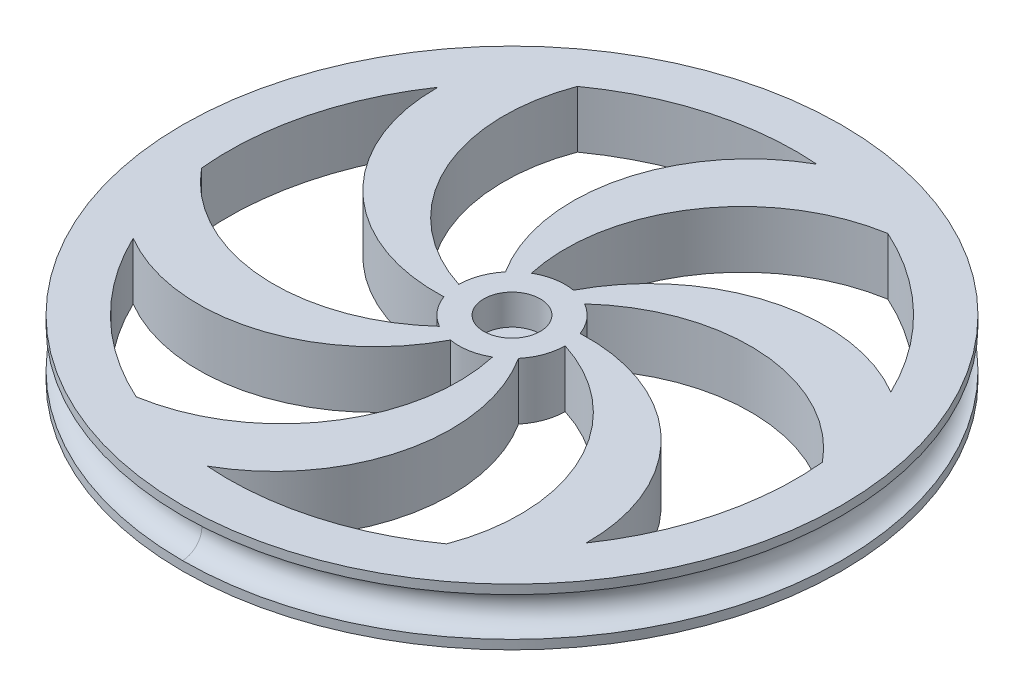
ISO-10303-21;
HEADER;
FILE_DESCRIPTION(('STEP AP214'),'2;1');
FILE_NAME('part.step','',(''),(''),'','','');
FILE_SCHEMA(('AUTOMOTIVE_DESIGN { 1 0 10303 214 1 1 1 1 }'));
ENDSEC;
DATA;
#1=APPLICATION_CONTEXT('core data for automotive mechanical design processes');
#2=APPLICATION_PROTOCOL_DEFINITION('international standard','automotive_design',2000,#1);
#3=PRODUCT_CONTEXT('',#1,'mechanical');
#4=PRODUCT('Part','Part','',(#3));
#5=PRODUCT_RELATED_PRODUCT_CATEGORY('part','',(#4));
#6=PRODUCT_DEFINITION_FORMATION('','',#4);
#7=PRODUCT_DEFINITION_CONTEXT('part definition',#1,'design');
#8=PRODUCT_DEFINITION('design','',#6,#7);
#9=PRODUCT_DEFINITION_SHAPE('','',#8);
#10=(LENGTH_UNIT() NAMED_UNIT(*) SI_UNIT(.MILLI.,.METRE.));
#11=(NAMED_UNIT(*) PLANE_ANGLE_UNIT() SI_UNIT($,.RADIAN.));
#12=(NAMED_UNIT(*) SI_UNIT($,.STERADIAN.) SOLID_ANGLE_UNIT());
#13=UNCERTAINTY_MEASURE_WITH_UNIT(LENGTH_MEASURE(1.E-05),#10,'distance_accuracy_value','');
#14=(GEOMETRIC_REPRESENTATION_CONTEXT(3) GLOBAL_UNCERTAINTY_ASSIGNED_CONTEXT((#13)) GLOBAL_UNIT_ASSIGNED_CONTEXT((#10,
#11,#12)) REPRESENTATION_CONTEXT('',''));
#15=CARTESIAN_POINT('',(0.,0.,0.));
#16=DIRECTION('',(0.,0.,1.));
#17=DIRECTION('',(1.,0.,0.));
#18=AXIS2_PLACEMENT_3D('',#15,#16,#17);
#19=CARTESIAN_POINT('',(0.,0.,0.));
#20=DIRECTION('',(0.,-1.,0.));
#21=DIRECTION('',(0.,0.,-1.));
#22=AXIS2_PLACEMENT_3D('',#19,#20,#21);
#23=CYLINDRICAL_SURFACE('',#22,1.2446);
#24=CARTESIAN_POINT('',(0.,0.,0.));
#25=DIRECTION('',(0.,-1.,0.));
#26=DIRECTION('',(0.,0.,-1.));
#27=AXIS2_PLACEMENT_3D('',#24,#25,#26);
#28=CIRCLE('',#27,1.2446);
#29=CARTESIAN_POINT('',(0.,0.,-1.2446));
#30=VERTEX_POINT('',#29);
#31=EDGE_CURVE('E675',#30,#30,#28,.T.);
#32=ORIENTED_EDGE('',*,*,#31,.T.);
#33=EDGE_LOOP('',(#32));
#34=FACE_BOUND('',#33,.T.);
#35=CARTESIAN_POINT('',(0.,2.2225,0.));
#36=DIRECTION('',(0.,1.,0.));
#37=DIRECTION('',(0.,0.,1.));
#38=AXIS2_PLACEMENT_3D('',#35,#36,#37);
#39=CIRCLE('',#38,1.2446);
#40=CARTESIAN_POINT('',(0.,2.2225,1.2446));
#41=VERTEX_POINT('',#40);
#42=EDGE_CURVE('E238',#41,#41,#39,.F.);
#43=ORIENTED_EDGE('',*,*,#42,.F.);
#44=EDGE_LOOP('',(#43));
#45=FACE_BOUND('',#44,.T.);
#46=ADVANCED_FACE('F234',(#34,#45),#23,.F.);
#47=CARTESIAN_POINT('',(0.,4.7625,0.));
#48=DIRECTION('',(0.,-1.,0.));
#49=DIRECTION('',(0.,0.,-1.));
#50=AXIS2_PLACEMENT_3D('',#47,#48,#49);
#51=CYLINDRICAL_SURFACE('',#50,27.559);
#52=CARTESIAN_POINT('',(0.,0.,0.));
#53=DIRECTION('',(0.,1.,0.));
#54=DIRECTION('',(0.,0.,1.));
#55=AXIS2_PLACEMENT_3D('',#52,#53,#54);
#56=CIRCLE('',#55,27.559);
#57=CARTESIAN_POINT('',(0.,0.,27.559));
#58=VERTEX_POINT('',#57);
#59=EDGE_CURVE('E695',#58,#58,#56,.T.);
#60=ORIENTED_EDGE('',*,*,#59,.T.);
#61=EDGE_LOOP('',(#60));
#62=FACE_BOUND('',#61,.T.);
#63=CARTESIAN_POINT('',(0.,0.762000000000004,0.));
#64=DIRECTION('',(0.,1.,0.));
#65=DIRECTION('',(0.,0.,1.));
#66=AXIS2_PLACEMENT_3D('',#63,#64,#65);
#67=CIRCLE('',#66,27.559);
#68=CARTESIAN_POINT('',(0.,0.762000000000004,27.559));
#69=VERTEX_POINT('',#68);
#70=CARTESIAN_POINT('',(-27.559,0.762000000000004,0.));
#71=VERTEX_POINT('',#70);
#72=EDGE_CURVE('E12',#69,#71,#67,.T.);
#73=ORIENTED_EDGE('',*,*,#72,.F.);
#74=CARTESIAN_POINT('',(0.,0.762000000000004,0.));
#75=DIRECTION('',(0.,1.,0.));
#76=DIRECTION('',(0.,0.,1.));
#77=AXIS2_PLACEMENT_3D('',#74,#75,#76);
#78=CIRCLE('',#77,27.559);
#79=EDGE_CURVE('E244',#71,#69,#78,.T.);
#80=ORIENTED_EDGE('',*,*,#79,.F.);
#81=EDGE_LOOP('',(#73,#80));
#82=FACE_BOUND('',#81,.T.);
#83=ADVANCED_FACE('F236',(#62,#82),#51,.T.);
#84=CARTESIAN_POINT('',(0.,0.,0.));
#85=DIRECTION('',(0.,1.,0.));
#86=DIRECTION('',(0.,0.,1.));
#87=AXIS2_PLACEMENT_3D('',#84,#85,#86);
#88=PLANE('',#87);
#89=CARTESIAN_POINT('',(0.,0.,0.));
#90=DIRECTION('',(0.,1.,0.));
#91=DIRECTION('',(0.,0.,1.));
#92=AXIS2_PLACEMENT_3D('',#89,#90,#91);
#93=CIRCLE('',#92,4.445);
#94=CARTESIAN_POINT('',(-0.771866149729499,0.,4.37747046213927));
#95=VERTEX_POINT('',#94);
#96=CARTESIAN_POINT('',(2.2225,0.,3.84948291982183));
#97=VERTEX_POINT('',#96);
#98=EDGE_CURVE('E512',#95,#97,#93,.T.);
#99=ORIENTED_EDGE('',*,*,#98,.F.);
#100=CARTESIAN_POINT('',(-13.8828348942131,0.,-2.44791836057071));
#101=DIRECTION('',(0.,1.,0.));
#102=DIRECTION('',(0.,0.,1.));
#103=AXIS2_PLACEMENT_3D('',#100,#101,#102);
#104=CIRCLE('',#103,14.7811851351642);
#105=CARTESIAN_POINT('',(-21.4129214501009,0.,10.2714067182547));
#106=VERTEX_POINT('',#105);
#107=EDGE_CURVE('E515',#95,#106,#104,.F.);
#108=ORIENTED_EDGE('',*,*,#107,.T.);
#109=CARTESIAN_POINT('',(0.,0.,0.));
#110=DIRECTION('',(0.,1.,0.));
#111=DIRECTION('',(0.,0.,1.));
#112=AXIS2_PLACEMENT_3D('',#109,#110,#111);
#113=CIRCLE('',#112,23.749);
#114=CARTESIAN_POINT('',(-9.80091651524777,0.,21.63231463485));
#115=VERTEX_POINT('',#114);
#116=EDGE_CURVE('E251',#106,#115,#113,.T.);
#117=ORIENTED_EDGE('',*,*,#116,.T.);
#118=CARTESIAN_POINT('',(-12.2083601171492,0.,7.0485));
#119=DIRECTION('',(0.,1.,0.));
#120=DIRECTION('',(0.,0.,1.));
#121=AXIS2_PLACEMENT_3D('',#118,#119,#120);
#122=CIRCLE('',#121,14.7811851351642);
#123=EDGE_CURVE('E522',#97,#115,#122,.F.);
#124=ORIENTED_EDGE('',*,*,#123,.F.);
#125=EDGE_LOOP('',(#99,#108,#117,#124));
#126=FACE_BOUND('',#125,.T.);
#127=CARTESIAN_POINT('',(0.,0.,0.));
#128=DIRECTION('',(0.,1.,0.));
#129=DIRECTION('',(0.,0.,1.));
#130=AXIS2_PLACEMENT_3D('',#127,#128,#129);
#131=CIRCLE('',#130,4.445);
#132=CARTESIAN_POINT('',(-4.17693369939336,0.,1.5202795370826));
#133=VERTEX_POINT('',#132);
#134=CARTESIAN_POINT('',(-2.2225,0.,3.84948291982183));
#135=VERTEX_POINT('',#134);
#136=EDGE_CURVE('E470',#133,#135,#131,.T.);
#137=ORIENTED_EDGE('',*,*,#136,.F.);
#138=CARTESIAN_POINT('',(-4.82145796046196,0.,-13.2468468752189));
#139=DIRECTION('',(0.,1.,0.));
#140=DIRECTION('',(0.,0.,1.));
#141=AXIS2_PLACEMENT_3D('',#138,#139,#140);
#142=CIRCLE('',#141,14.7811851351642);
#143=CARTESIAN_POINT('',(-19.6017598756612,0.,-13.4084305859008));
#144=VERTEX_POINT('',#143);
#145=EDGE_CURVE('E473',#133,#144,#142,.F.);
#146=ORIENTED_EDGE('',*,*,#145,.T.);
#147=CARTESIAN_POINT('',(0.,0.,0.));
#148=DIRECTION('',(0.,1.,0.));
#149=DIRECTION('',(0.,0.,1.));
#150=AXIS2_PLACEMENT_3D('',#147,#148,#149);
#151=CIRCLE('',#150,23.749);
#152=CARTESIAN_POINT('',(-23.6345922740618,0.,2.32831463484995));
#153=VERTEX_POINT('',#152);
#154=EDGE_CURVE('E259',#144,#153,#151,.T.);
#155=ORIENTED_EDGE('',*,*,#154,.T.);
#156=CARTESIAN_POINT('',(-12.2083601171492,0.,-7.0485));
#157=DIRECTION('',(0.,1.,0.));
#158=DIRECTION('',(0.,0.,1.));
#159=AXIS2_PLACEMENT_3D('',#156,#157,#158);
#160=CIRCLE('',#159,14.7811851351642);
#161=EDGE_CURVE('E480',#135,#153,#160,.F.);
#162=ORIENTED_EDGE('',*,*,#161,.F.);
#163=EDGE_LOOP('',(#137,#146,#155,#162));
#164=FACE_BOUND('',#163,.T.);
#165=CARTESIAN_POINT('',(12.2083601171492,0.,7.04849999999999));
#166=DIRECTION('',(0.,1.,0.));
#167=DIRECTION('',(0.,0.,1.));
#168=AXIS2_PLACEMENT_3D('',#165,#166,#167);
#169=CIRCLE('',#168,14.7811851351642);
#170=CARTESIAN_POINT('',(2.2225,0.,-3.84948291982183));
#171=VERTEX_POINT('',#170);
#172=CARTESIAN_POINT('',(23.6345922740618,0.,-2.32831463484997));
#173=VERTEX_POINT('',#172);
#174=EDGE_CURVE('E598',#171,#173,#169,.F.);
#175=ORIENTED_EDGE('',*,*,#174,.F.);
#176=CARTESIAN_POINT('',(0.,0.,0.));
#177=DIRECTION('',(0.,1.,0.));
#178=DIRECTION('',(0.,0.,1.));
#179=AXIS2_PLACEMENT_3D('',#176,#177,#178);
#180=CIRCLE('',#179,4.445);
#181=CARTESIAN_POINT('',(4.17693369939336,0.,-1.5202795370826));
#182=VERTEX_POINT('',#181);
#183=EDGE_CURVE('E601',#182,#171,#180,.T.);
#184=ORIENTED_EDGE('',*,*,#183,.F.);
#185=CARTESIAN_POINT('',(4.82145796046196,0.,13.2468468752189));
#186=DIRECTION('',(0.,1.,0.));
#187=DIRECTION('',(0.,0.,1.));
#188=AXIS2_PLACEMENT_3D('',#185,#186,#187);
#189=CIRCLE('',#188,14.7811851351642);
#190=CARTESIAN_POINT('',(19.6017598756612,0.,13.4084305859008));
#191=VERTEX_POINT('',#190);
#192=EDGE_CURVE('E605',#182,#191,#189,.F.);
#193=ORIENTED_EDGE('',*,*,#192,.T.);
#194=CARTESIAN_POINT('',(0.,0.,0.));
#195=DIRECTION('',(0.,1.,0.));
#196=DIRECTION('',(0.,0.,1.));
#197=AXIS2_PLACEMENT_3D('',#194,#195,#196);
#198=CIRCLE('',#197,23.749);
#199=EDGE_CURVE('E609',#191,#173,#198,.T.);
#200=ORIENTED_EDGE('',*,*,#199,.T.);
#201=EDGE_LOOP('',(#175,#184,#193,#200));
#202=FACE_BOUND('',#201,.T.);
#203=CARTESIAN_POINT('',(0.,0.,0.));
#204=DIRECTION('',(0.,1.,0.));
#205=DIRECTION('',(0.,0.,1.));
#206=AXIS2_PLACEMENT_3D('',#203,#204,#205);
#207=CIRCLE('',#206,4.445);
#208=CARTESIAN_POINT('',(3.40506754966386,0.,2.85719092505666));
#209=VERTEX_POINT('',#208);
#210=CARTESIAN_POINT('',(4.445,0.,0.));
#211=VERTEX_POINT('',#210);
#212=EDGE_CURVE('E554',#209,#211,#207,.T.);
#213=ORIENTED_EDGE('',*,*,#212,.F.);
#214=CARTESIAN_POINT('',(-9.06137693375113,0.,10.7989285146482));
#215=DIRECTION('',(0.,1.,0.));
#216=DIRECTION('',(0.,0.,1.));
#217=AXIS2_PLACEMENT_3D('',#214,#215,#216);
#218=CIRCLE('',#217,14.7811851351642);
#219=CARTESIAN_POINT('',(-1.8111615744397,0.,23.6798373041555));
#220=VERTEX_POINT('',#219);
#221=EDGE_CURVE('E557',#209,#220,#218,.F.);
#222=ORIENTED_EDGE('',*,*,#221,.T.);
#223=CARTESIAN_POINT('',(0.,0.,0.));
#224=DIRECTION('',(0.,1.,0.));
#225=DIRECTION('',(0.,0.,1.));
#226=AXIS2_PLACEMENT_3D('',#223,#224,#225);
#227=CIRCLE('',#226,23.749);
#228=CARTESIAN_POINT('',(13.8336757588141,0.,19.304));
#229=VERTEX_POINT('',#228);
#230=EDGE_CURVE('E562',#220,#229,#227,.T.);
#231=ORIENTED_EDGE('',*,*,#230,.T.);
#232=CARTESIAN_POINT('',(0.,0.,14.097));
#233=DIRECTION('',(0.,1.,0.));
#234=DIRECTION('',(0.,0.,1.));
#235=AXIS2_PLACEMENT_3D('',#232,#233,#234);
#236=CIRCLE('',#235,14.7811851351642);
#237=EDGE_CURVE('E566',#211,#229,#236,.F.);
#238=ORIENTED_EDGE('',*,*,#237,.F.);
#239=EDGE_LOOP('',(#213,#222,#231,#238));
#240=FACE_BOUND('',#239,.T.);
#241=CARTESIAN_POINT('',(0.,0.,0.));
#242=DIRECTION('',(0.,1.,0.));
#243=DIRECTION('',(0.,0.,1.));
#244=AXIS2_PLACEMENT_3D('',#241,#242,#243);
#245=CIRCLE('',#244,4.445);
#246=CARTESIAN_POINT('',(-3.40506754966386,0.,-2.85719092505667));
#247=VERTEX_POINT('',#246);
#248=CARTESIAN_POINT('',(-4.445,0.,0.));
#249=VERTEX_POINT('',#248);
#250=EDGE_CURVE('E415',#247,#249,#245,.T.);
#251=ORIENTED_EDGE('',*,*,#250,.F.);
#252=CARTESIAN_POINT('',(9.06137693375113,0.,-10.7989285146482));
#253=DIRECTION('',(0.,1.,0.));
#254=DIRECTION('',(0.,0.,1.));
#255=AXIS2_PLACEMENT_3D('',#252,#253,#254);
#256=CIRCLE('',#255,14.7811851351642);
#257=CARTESIAN_POINT('',(1.81116157443972,0.,-23.6798373041555));
#258=VERTEX_POINT('',#257);
#259=EDGE_CURVE('E428',#247,#258,#256,.F.);
#260=ORIENTED_EDGE('',*,*,#259,.T.);
#261=CARTESIAN_POINT('',(0.,0.,0.));
#262=DIRECTION('',(0.,1.,0.));
#263=DIRECTION('',(0.,0.,1.));
#264=AXIS2_PLACEMENT_3D('',#261,#262,#263);
#265=CIRCLE('',#264,23.749);
#266=CARTESIAN_POINT('',(-13.8336757588141,0.,-19.304));
#267=VERTEX_POINT('',#266);
#268=EDGE_CURVE('E433',#258,#267,#265,.T.);
#269=ORIENTED_EDGE('',*,*,#268,.T.);
#270=CARTESIAN_POINT('',(0.,0.,-14.097));
#271=DIRECTION('',(0.,1.,0.));
#272=DIRECTION('',(0.,0.,1.));
#273=AXIS2_PLACEMENT_3D('',#270,#271,#272);
#274=CIRCLE('',#273,14.7811851351642);
#275=EDGE_CURVE('E424',#249,#267,#274,.F.);
#276=ORIENTED_EDGE('',*,*,#275,.F.);
#277=EDGE_LOOP('',(#251,#260,#269,#276));
#278=FACE_BOUND('',#277,.T.);
#279=CARTESIAN_POINT('',(0.,0.,0.));
#280=DIRECTION('',(0.,1.,0.));
#281=DIRECTION('',(0.,0.,1.));
#282=AXIS2_PLACEMENT_3D('',#279,#280,#281);
#283=CIRCLE('',#282,4.445);
#284=CARTESIAN_POINT('',(0.771866149729505,0.,-4.37747046213926));
#285=VERTEX_POINT('',#284);
#286=CARTESIAN_POINT('',(-2.2225,0.,-3.84948291982183));
#287=VERTEX_POINT('',#286);
#288=EDGE_CURVE('E641',#285,#287,#283,.T.);
#289=ORIENTED_EDGE('',*,*,#288,.F.);
#290=CARTESIAN_POINT('',(13.8828348942131,0.,2.44791836057069));
#291=DIRECTION('',(0.,1.,0.));
#292=DIRECTION('',(0.,0.,1.));
#293=AXIS2_PLACEMENT_3D('',#290,#291,#292);
#294=CIRCLE('',#293,14.7811851351642);
#295=CARTESIAN_POINT('',(21.4129214501009,0.,-10.2714067182547));
#296=VERTEX_POINT('',#295);
#297=EDGE_CURVE('E644',#285,#296,#294,.F.);
#298=ORIENTED_EDGE('',*,*,#297,.T.);
#299=CARTESIAN_POINT('',(0.,0.,0.));
#300=DIRECTION('',(0.,1.,0.));
#301=DIRECTION('',(0.,0.,1.));
#302=AXIS2_PLACEMENT_3D('',#299,#300,#301);
#303=CIRCLE('',#302,23.749);
#304=CARTESIAN_POINT('',(9.80091651524776,0.,-21.63231463485));
#305=VERTEX_POINT('',#304);
#306=EDGE_CURVE('E649',#296,#305,#303,.T.);
#307=ORIENTED_EDGE('',*,*,#306,.T.);
#308=CARTESIAN_POINT('',(12.2083601171492,0.,-7.0485));
#309=DIRECTION('',(0.,1.,0.));
#310=DIRECTION('',(0.,0.,1.));
#311=AXIS2_PLACEMENT_3D('',#308,#309,#310);
#312=CIRCLE('',#311,14.7811851351642);
#313=EDGE_CURVE('E653',#287,#305,#312,.F.);
#314=ORIENTED_EDGE('',*,*,#313,.F.);
#315=EDGE_LOOP('',(#289,#298,#307,#314));
#316=FACE_BOUND('',#315,.T.);
#317=ORIENTED_EDGE('',*,*,#31,.F.);
#318=EDGE_LOOP('',(#317));
#319=FACE_BOUND('',#318,.T.);
#320=ORIENTED_EDGE('',*,*,#59,.F.);
#321=EDGE_LOOP('',(#320));
#322=FACE_BOUND('',#321,.T.);
#323=ADVANCED_FACE('F436',(#126,#164,#202,#240,#278,#316,#319,#322),#88,.F.);
#324=CARTESIAN_POINT('',(0.,2.38125,0.));
#325=DIRECTION('',(0.,-1.,0.));
#326=DIRECTION('',(0.,0.,-1.));
#327=AXIS2_PLACEMENT_3D('',#324,#325,#326);
#328=TOROIDAL_SURFACE('',#327,27.559,1.61925);
#329=ORIENTED_EDGE('',*,*,#72,.T.);
#330=CARTESIAN_POINT('',(-27.559,2.38125,0.));
#331=DIRECTION('',(0.,0.,1.));
#332=DIRECTION('',(1.,0.,0.));
#333=AXIS2_PLACEMENT_3D('',#330,#331,#332);
#334=CIRCLE('',#333,1.61925);
#335=CARTESIAN_POINT('',(-27.559,4.0005,0.));
#336=VERTEX_POINT('',#335);
#337=EDGE_CURVE('E688',#71,#336,#334,.T.);
#338=ORIENTED_EDGE('',*,*,#337,.T.);
#339=CARTESIAN_POINT('',(0.,4.0005,0.));
#340=DIRECTION('',(0.,-1.,0.));
#341=DIRECTION('',(0.,0.,-1.));
#342=AXIS2_PLACEMENT_3D('',#339,#340,#341);
#343=CIRCLE('',#342,27.559);
#344=CARTESIAN_POINT('',(0.,4.0005,27.559));
#345=VERTEX_POINT('',#344);
#346=EDGE_CURVE('E706',#336,#345,#343,.T.);
#347=ORIENTED_EDGE('',*,*,#346,.T.);
#348=CARTESIAN_POINT('',(0.,2.38125,27.559));
#349=DIRECTION('',(1.,0.,0.));
#350=DIRECTION('',(0.,0.,-1.));
#351=AXIS2_PLACEMENT_3D('',#348,#349,#350);
#352=CIRCLE('',#351,1.61925);
#353=EDGE_CURVE('E692',#69,#345,#352,.T.);
#354=ORIENTED_EDGE('',*,*,#353,.F.);
#355=EDGE_LOOP('',(#329,#338,#347,#354));
#356=FACE_BOUND('',#355,.T.);
#357=ADVANCED_FACE('F718',(#356),#328,.F.);
#358=CARTESIAN_POINT('',(0.,2.38125,0.));
#359=DIRECTION('',(0.,-1.,0.));
#360=DIRECTION('',(0.,0.,-1.));
#361=AXIS2_PLACEMENT_3D('',#358,#359,#360);
#362=TOROIDAL_SURFACE('',#361,27.559,1.61925);
#363=ORIENTED_EDGE('',*,*,#79,.T.);
#364=ORIENTED_EDGE('',*,*,#353,.T.);
#365=CARTESIAN_POINT('',(0.,4.0005,0.));
#366=DIRECTION('',(0.,-1.,0.));
#367=DIRECTION('',(0.,0.,-1.));
#368=AXIS2_PLACEMENT_3D('',#365,#366,#367);
#369=CIRCLE('',#368,27.559);
#370=EDGE_CURVE('E700',#345,#336,#369,.T.);
#371=ORIENTED_EDGE('',*,*,#370,.T.);
#372=ORIENTED_EDGE('',*,*,#337,.F.);
#373=EDGE_LOOP('',(#363,#364,#371,#372));
#374=FACE_BOUND('',#373,.T.);
#375=ADVANCED_FACE('F714',(#374),#362,.F.);
#376=CARTESIAN_POINT('',(0.,4.7625,0.));
#377=DIRECTION('',(0.,1.,0.));
#378=DIRECTION('',(0.,0.,1.));
#379=AXIS2_PLACEMENT_3D('',#376,#377,#378);
#380=PLANE('',#379);
#381=CARTESIAN_POINT('',(0.,4.7625,0.));
#382=DIRECTION('',(0.,1.,0.));
#383=DIRECTION('',(0.,0.,1.));
#384=AXIS2_PLACEMENT_3D('',#381,#382,#383);
#385=CIRCLE('',#384,2.3622);
#386=CARTESIAN_POINT('',(0.,4.7625,2.3622));
#387=VERTEX_POINT('',#386);
#388=EDGE_CURVE('E446',#387,#387,#385,.T.);
#389=ORIENTED_EDGE('',*,*,#388,.F.);
#390=EDGE_LOOP('',(#389));
#391=FACE_BOUND('',#390,.T.);
#392=CARTESIAN_POINT('',(-13.8828348942131,4.7625,-2.44791836057071));
#393=DIRECTION('',(0.,1.,0.));
#394=DIRECTION('',(0.,0.,1.));
#395=AXIS2_PLACEMENT_3D('',#392,#393,#394);
#396=CIRCLE('',#395,14.7811851351642);
#397=CARTESIAN_POINT('',(-0.771866149729499,4.7625,4.37747046213926));
#398=VERTEX_POINT('',#397);
#399=CARTESIAN_POINT('',(-21.4129214501009,4.7625,10.2714067182547));
#400=VERTEX_POINT('',#399);
#401=EDGE_CURVE('E529',#398,#400,#396,.F.);
#402=ORIENTED_EDGE('',*,*,#401,.F.);
#403=CARTESIAN_POINT('',(0.,4.7625,0.));
#404=DIRECTION('',(0.,1.,0.));
#405=DIRECTION('',(0.,0.,1.));
#406=AXIS2_PLACEMENT_3D('',#403,#404,#405);
#407=CIRCLE('',#406,4.445);
#408=CARTESIAN_POINT('',(2.2225,4.7625,3.84948291982183));
#409=VERTEX_POINT('',#408);
#410=EDGE_CURVE('E502',#398,#409,#407,.T.);
#411=ORIENTED_EDGE('',*,*,#410,.T.);
#412=CARTESIAN_POINT('',(-12.2083601171492,4.7625,7.0485));
#413=DIRECTION('',(0.,1.,0.));
#414=DIRECTION('',(0.,0.,1.));
#415=AXIS2_PLACEMENT_3D('',#412,#413,#414);
#416=CIRCLE('',#415,14.7811851351642);
#417=CARTESIAN_POINT('',(-9.80091651524777,4.7625,21.63231463485));
#418=VERTEX_POINT('',#417);
#419=EDGE_CURVE('E516',#409,#418,#416,.F.);
#420=ORIENTED_EDGE('',*,*,#419,.T.);
#421=CARTESIAN_POINT('',(0.,4.7625,0.));
#422=DIRECTION('',(0.,1.,0.));
#423=DIRECTION('',(0.,0.,1.));
#424=AXIS2_PLACEMENT_3D('',#421,#422,#423);
#425=CIRCLE('',#424,23.749);
#426=EDGE_CURVE('E533',#400,#418,#425,.T.);
#427=ORIENTED_EDGE('',*,*,#426,.F.);
#428=EDGE_LOOP('',(#402,#411,#420,#427));
#429=FACE_BOUND('',#428,.T.);
#430=CARTESIAN_POINT('',(-4.82145796046196,4.7625,-13.2468468752189));
#431=DIRECTION('',(0.,1.,0.));
#432=DIRECTION('',(0.,0.,1.));
#433=AXIS2_PLACEMENT_3D('',#430,#431,#432);
#434=CIRCLE('',#433,14.7811851351642);
#435=CARTESIAN_POINT('',(-4.17693369939336,4.7625,1.5202795370826));
#436=VERTEX_POINT('',#435);
#437=CARTESIAN_POINT('',(-19.6017598756612,4.7625,-13.4084305859008));
#438=VERTEX_POINT('',#437);
#439=EDGE_CURVE('E487',#436,#438,#434,.F.);
#440=ORIENTED_EDGE('',*,*,#439,.F.);
#441=CARTESIAN_POINT('',(0.,4.7625,0.));
#442=DIRECTION('',(0.,1.,0.));
#443=DIRECTION('',(0.,0.,1.));
#444=AXIS2_PLACEMENT_3D('',#441,#442,#443);
#445=CIRCLE('',#444,4.445);
#446=CARTESIAN_POINT('',(-2.2225,4.7625,3.84948291982183));
#447=VERTEX_POINT('',#446);
#448=EDGE_CURVE('E464',#436,#447,#445,.T.);
#449=ORIENTED_EDGE('',*,*,#448,.T.);
#450=CARTESIAN_POINT('',(-12.2083601171492,4.7625,-7.0485));
#451=DIRECTION('',(0.,1.,0.));
#452=DIRECTION('',(0.,0.,1.));
#453=AXIS2_PLACEMENT_3D('',#450,#451,#452);
#454=CIRCLE('',#453,14.7811851351642);
#455=CARTESIAN_POINT('',(-23.6345922740618,4.7625,2.32831463484995));
#456=VERTEX_POINT('',#455);
#457=EDGE_CURVE('E474',#447,#456,#454,.F.);
#458=ORIENTED_EDGE('',*,*,#457,.T.);
#459=CARTESIAN_POINT('',(0.,4.7625,0.));
#460=DIRECTION('',(0.,1.,0.));
#461=DIRECTION('',(0.,0.,1.));
#462=AXIS2_PLACEMENT_3D('',#459,#460,#461);
#463=CIRCLE('',#462,23.749);
#464=EDGE_CURVE('E491',#438,#456,#463,.T.);
#465=ORIENTED_EDGE('',*,*,#464,.F.);
#466=EDGE_LOOP('',(#440,#449,#458,#465));
#467=FACE_BOUND('',#466,.T.);
#468=CARTESIAN_POINT('',(0.,4.7625,0.));
#469=DIRECTION('',(0.,1.,0.));
#470=DIRECTION('',(0.,0.,1.));
#471=AXIS2_PLACEMENT_3D('',#468,#469,#470);
#472=CIRCLE('',#471,4.445);
#473=CARTESIAN_POINT('',(4.17693369939336,4.7625,-1.5202795370826));
#474=VERTEX_POINT('',#473);
#475=CARTESIAN_POINT('',(2.2225,4.7625,-3.84948291982183));
#476=VERTEX_POINT('',#475);
#477=EDGE_CURVE('E617',#474,#476,#472,.T.);
#478=ORIENTED_EDGE('',*,*,#477,.T.);
#479=CARTESIAN_POINT('',(12.2083601171492,4.7625,7.04849999999999));
#480=DIRECTION('',(0.,1.,0.));
#481=DIRECTION('',(0.,0.,1.));
#482=AXIS2_PLACEMENT_3D('',#479,#480,#481);
#483=CIRCLE('',#482,14.7811851351642);
#484=CARTESIAN_POINT('',(23.6345922740618,4.7625,-2.32831463484997));
#485=VERTEX_POINT('',#484);
#486=EDGE_CURVE('E588',#476,#485,#483,.F.);
#487=ORIENTED_EDGE('',*,*,#486,.T.);
#488=CARTESIAN_POINT('',(0.,4.7625,0.));
#489=DIRECTION('',(0.,1.,0.));
#490=DIRECTION('',(0.,0.,1.));
#491=AXIS2_PLACEMENT_3D('',#488,#489,#490);
#492=CIRCLE('',#491,23.749);
#493=CARTESIAN_POINT('',(19.6017598756612,4.7625,13.4084305859008));
#494=VERTEX_POINT('',#493);
#495=EDGE_CURVE('E602',#494,#485,#492,.T.);
#496=ORIENTED_EDGE('',*,*,#495,.F.);
#497=CARTESIAN_POINT('',(4.82145796046196,4.7625,13.2468468752189));
#498=DIRECTION('',(0.,1.,0.));
#499=DIRECTION('',(0.,0.,1.));
#500=AXIS2_PLACEMENT_3D('',#497,#498,#499);
#501=CIRCLE('',#500,14.7811851351642);
#502=EDGE_CURVE('E621',#474,#494,#501,.F.);
#503=ORIENTED_EDGE('',*,*,#502,.F.);
#504=EDGE_LOOP('',(#478,#487,#496,#503));
#505=FACE_BOUND('',#504,.T.);
#506=CARTESIAN_POINT('',(-9.06137693375113,4.7625,10.7989285146482));
#507=DIRECTION('',(0.,1.,0.));
#508=DIRECTION('',(0.,0.,1.));
#509=AXIS2_PLACEMENT_3D('',#506,#507,#508);
#510=CIRCLE('',#509,14.7811851351642);
#511=CARTESIAN_POINT('',(3.40506754966386,4.7625,2.85719092505666));
#512=VERTEX_POINT('',#511);
#513=CARTESIAN_POINT('',(-1.8111615744397,4.7625,23.6798373041555));
#514=VERTEX_POINT('',#513);
#515=EDGE_CURVE('E573',#512,#514,#510,.F.);
#516=ORIENTED_EDGE('',*,*,#515,.F.);
#517=CARTESIAN_POINT('',(0.,4.7625,0.));
#518=DIRECTION('',(0.,1.,0.));
#519=DIRECTION('',(0.,0.,1.));
#520=AXIS2_PLACEMENT_3D('',#517,#518,#519);
#521=CIRCLE('',#520,4.445);
#522=CARTESIAN_POINT('',(4.445,4.7625,0.));
#523=VERTEX_POINT('',#522);
#524=EDGE_CURVE('E544',#512,#523,#521,.T.);
#525=ORIENTED_EDGE('',*,*,#524,.T.);
#526=CARTESIAN_POINT('',(0.,4.7625,14.097));
#527=DIRECTION('',(0.,1.,0.));
#528=DIRECTION('',(0.,0.,1.));
#529=AXIS2_PLACEMENT_3D('',#526,#527,#528);
#530=CIRCLE('',#529,14.7811851351642);
#531=CARTESIAN_POINT('',(13.8336757588141,4.7625,19.304));
#532=VERTEX_POINT('',#531);
#533=EDGE_CURVE('E558',#523,#532,#530,.F.);
#534=ORIENTED_EDGE('',*,*,#533,.T.);
#535=CARTESIAN_POINT('',(0.,4.7625,0.));
#536=DIRECTION('',(0.,1.,0.));
#537=DIRECTION('',(0.,0.,1.));
#538=AXIS2_PLACEMENT_3D('',#535,#536,#537);
#539=CIRCLE('',#538,23.749);
#540=EDGE_CURVE('E577',#514,#532,#539,.T.);
#541=ORIENTED_EDGE('',*,*,#540,.F.);
#542=EDGE_LOOP('',(#516,#525,#534,#541));
#543=FACE_BOUND('',#542,.T.);
#544=CARTESIAN_POINT('',(9.06137693375113,4.7625,-10.7989285146482));
#545=DIRECTION('',(0.,1.,0.));
#546=DIRECTION('',(0.,0.,1.));
#547=AXIS2_PLACEMENT_3D('',#544,#545,#546);
#548=CIRCLE('',#547,14.7811851351642);
#549=CARTESIAN_POINT('',(-3.40506754966386,4.7625,-2.85719092505667));
#550=VERTEX_POINT('',#549);
#551=CARTESIAN_POINT('',(1.81116157443972,4.7625,-23.6798373041555));
#552=VERTEX_POINT('',#551);
#553=EDGE_CURVE('E455',#550,#552,#548,.F.);
#554=ORIENTED_EDGE('',*,*,#553,.F.);
#555=CARTESIAN_POINT('',(0.,4.7625,0.));
#556=DIRECTION('',(0.,1.,0.));
#557=DIRECTION('',(0.,0.,1.));
#558=AXIS2_PLACEMENT_3D('',#555,#556,#557);
#559=CIRCLE('',#558,4.445);
#560=CARTESIAN_POINT('',(-4.445,4.7625,0.));
#561=VERTEX_POINT('',#560);
#562=EDGE_CURVE('E418',#550,#561,#559,.T.);
#563=ORIENTED_EDGE('',*,*,#562,.T.);
#564=CARTESIAN_POINT('',(0.,4.7625,-14.097));
#565=DIRECTION('',(0.,1.,0.));
#566=DIRECTION('',(0.,0.,1.));
#567=AXIS2_PLACEMENT_3D('',#564,#565,#566);
#568=CIRCLE('',#567,14.7811851351642);
#569=CARTESIAN_POINT('',(-13.8336757588141,4.7625,-19.304));
#570=VERTEX_POINT('',#569);
#571=EDGE_CURVE('E439',#561,#570,#568,.F.);
#572=ORIENTED_EDGE('',*,*,#571,.T.);
#573=CARTESIAN_POINT('',(0.,4.7625,0.));
#574=DIRECTION('',(0.,1.,0.));
#575=DIRECTION('',(0.,0.,1.));
#576=AXIS2_PLACEMENT_3D('',#573,#574,#575);
#577=CIRCLE('',#576,23.749);
#578=EDGE_CURVE('E443',#552,#570,#577,.T.);
#579=ORIENTED_EDGE('',*,*,#578,.F.);
#580=EDGE_LOOP('',(#554,#563,#572,#579));
#581=FACE_BOUND('',#580,.T.);
#582=CARTESIAN_POINT('',(13.8828348942131,4.7625,2.44791836057069));
#583=DIRECTION('',(0.,1.,0.));
#584=DIRECTION('',(0.,0.,1.));
#585=AXIS2_PLACEMENT_3D('',#582,#583,#584);
#586=CIRCLE('',#585,14.7811851351642);
#587=CARTESIAN_POINT('',(0.771866149729504,4.7625,-4.37747046213926));
#588=VERTEX_POINT('',#587);
#589=CARTESIAN_POINT('',(21.4129214501009,4.7625,-10.2714067182547));
#590=VERTEX_POINT('',#589);
#591=EDGE_CURVE('E660',#588,#590,#586,.F.);
#592=ORIENTED_EDGE('',*,*,#591,.F.);
#593=CARTESIAN_POINT('',(0.,4.7625,0.));
#594=DIRECTION('',(0.,1.,0.));
#595=DIRECTION('',(0.,0.,1.));
#596=AXIS2_PLACEMENT_3D('',#593,#594,#595);
#597=CIRCLE('',#596,4.445);
#598=CARTESIAN_POINT('',(-2.2225,4.7625,-3.84948291982183));
#599=VERTEX_POINT('',#598);
#600=EDGE_CURVE('E631',#588,#599,#597,.T.);
#601=ORIENTED_EDGE('',*,*,#600,.T.);
#602=CARTESIAN_POINT('',(12.2083601171492,4.7625,-7.0485));
#603=DIRECTION('',(0.,1.,0.));
#604=DIRECTION('',(0.,0.,1.));
#605=AXIS2_PLACEMENT_3D('',#602,#603,#604);
#606=CIRCLE('',#605,14.7811851351642);
#607=CARTESIAN_POINT('',(9.80091651524776,4.7625,-21.63231463485));
#608=VERTEX_POINT('',#607);
#609=EDGE_CURVE('E645',#599,#608,#606,.F.);
#610=ORIENTED_EDGE('',*,*,#609,.T.);
#611=CARTESIAN_POINT('',(0.,4.7625,0.));
#612=DIRECTION('',(0.,1.,0.));
#613=DIRECTION('',(0.,0.,1.));
#614=AXIS2_PLACEMENT_3D('',#611,#612,#613);
#615=CIRCLE('',#614,23.749);
#616=EDGE_CURVE('E664',#590,#608,#615,.T.);
#617=ORIENTED_EDGE('',*,*,#616,.F.);
#618=EDGE_LOOP('',(#592,#601,#610,#617));
#619=FACE_BOUND('',#618,.T.);
#620=CARTESIAN_POINT('',(0.,4.7625,0.));
#621=DIRECTION('',(0.,1.,0.));
#622=DIRECTION('',(0.,0.,1.));
#623=AXIS2_PLACEMENT_3D('',#620,#621,#622);
#624=CIRCLE('',#623,27.559);
#625=CARTESIAN_POINT('',(0.,4.7625,27.559));
#626=VERTEX_POINT('',#625);
#627=EDGE_CURVE('E696',#626,#626,#624,.T.);
#628=ORIENTED_EDGE('',*,*,#627,.T.);
#629=EDGE_LOOP('',(#628));
#630=FACE_BOUND('',#629,.T.);
#631=ADVANCED_FACE('F733',(#391,#429,#467,#505,#543,#581,#619,#630),#380,.T.);
#632=ORIENTED_EDGE('',*,*,#627,.F.);
#633=EDGE_LOOP('',(#632));
#634=FACE_BOUND('',#633,.T.);
#635=ORIENTED_EDGE('',*,*,#346,.F.);
#636=ORIENTED_EDGE('',*,*,#370,.F.);
#637=EDGE_LOOP('',(#635,#636));
#638=FACE_BOUND('',#637,.T.);
#639=ADVANCED_FACE('F723',(#634,#638),#51,.T.);
#640=CARTESIAN_POINT('',(0.,0.,0.));
#641=DIRECTION('',(0.,1.,0.));
#642=DIRECTION('',(0.,0.,1.));
#643=AXIS2_PLACEMENT_3D('',#640,#641,#642);
#644=CYLINDRICAL_SURFACE('',#643,4.445);
#645=ORIENTED_EDGE('',*,*,#600,.F.);
#646=DIRECTION('',(0.,1.,0.));
#647=VECTOR('',#646,1.);
#648=CARTESIAN_POINT('',(0.771866149729505,0.,-4.37747046213926));
#649=LINE('',#648,#647);
#650=EDGE_CURVE('E656',#285,#588,#649,.T.);
#651=ORIENTED_EDGE('',*,*,#650,.F.);
#652=ORIENTED_EDGE('',*,*,#288,.T.);
#653=DIRECTION('',(0.,1.,0.));
#654=VECTOR('',#653,1.);
#655=CARTESIAN_POINT('',(-2.2225,0.,-3.84948291982183));
#656=LINE('',#655,#654);
#657=EDGE_CURVE('E671',#287,#599,#656,.T.);
#658=ORIENTED_EDGE('',*,*,#657,.T.);
#659=EDGE_LOOP('',(#645,#651,#652,#658));
#660=FACE_BOUND('',#659,.T.);
#661=ADVANCED_FACE('F732',(#660),#644,.T.);
#662=CARTESIAN_POINT('',(12.2083601171492,0.,-7.0485));
#663=DIRECTION('',(0.,1.,0.));
#664=DIRECTION('',(0.,0.,1.));
#665=AXIS2_PLACEMENT_3D('',#662,#663,#664);
#666=CYLINDRICAL_SURFACE('',#665,14.7811851351642);
#667=ORIENTED_EDGE('',*,*,#609,.F.);
#668=ORIENTED_EDGE('',*,*,#657,.F.);
#669=ORIENTED_EDGE('',*,*,#313,.T.);
#670=DIRECTION('',(0.,1.,0.));
#671=VECTOR('',#670,1.);
#672=CARTESIAN_POINT('',(9.80091651524776,0.,-21.63231463485));
#673=LINE('',#672,#671);
#674=EDGE_CURVE('E676',#305,#608,#673,.T.);
#675=ORIENTED_EDGE('',*,*,#674,.T.);
#676=EDGE_LOOP('',(#667,#668,#669,#675));
#677=FACE_BOUND('',#676,.T.);
#678=ADVANCED_FACE('F739',(#677),#666,.F.);
#679=CARTESIAN_POINT('',(0.,0.,0.));
#680=DIRECTION('',(0.,1.,0.));
#681=DIRECTION('',(0.,0.,1.));
#682=AXIS2_PLACEMENT_3D('',#679,#680,#681);
#683=CYLINDRICAL_SURFACE('',#682,23.749);
#684=ORIENTED_EDGE('',*,*,#616,.T.);
#685=ORIENTED_EDGE('',*,*,#674,.F.);
#686=ORIENTED_EDGE('',*,*,#306,.F.);
#687=DIRECTION('',(0.,1.,0.));
#688=VECTOR('',#687,1.);
#689=CARTESIAN_POINT('',(21.4129214501009,0.,-10.2714067182547));
#690=LINE('',#689,#688);
#691=EDGE_CURVE('E679',#296,#590,#690,.T.);
#692=ORIENTED_EDGE('',*,*,#691,.T.);
#693=EDGE_LOOP('',(#684,#685,#686,#692));
#694=FACE_BOUND('',#693,.T.);
#695=ADVANCED_FACE('F759',(#694),#683,.F.);
#696=CARTESIAN_POINT('',(13.8828348942131,0.,2.44791836057069));
#697=DIRECTION('',(0.,1.,0.));
#698=DIRECTION('',(0.,0.,1.));
#699=AXIS2_PLACEMENT_3D('',#696,#697,#698);
#700=CYLINDRICAL_SURFACE('',#699,14.7811851351642);
#701=ORIENTED_EDGE('',*,*,#591,.T.);
#702=ORIENTED_EDGE('',*,*,#691,.F.);
#703=ORIENTED_EDGE('',*,*,#297,.F.);
#704=ORIENTED_EDGE('',*,*,#650,.T.);
#705=EDGE_LOOP('',(#701,#702,#703,#704));
#706=FACE_BOUND('',#705,.T.);
#707=ADVANCED_FACE('F756',(#706),#700,.T.);
#708=CARTESIAN_POINT('',(0.,0.,0.));
#709=DIRECTION('',(0.,1.,0.));
#710=DIRECTION('',(0.,0.,1.));
#711=AXIS2_PLACEMENT_3D('',#708,#709,#710);
#712=CYLINDRICAL_SURFACE('',#711,4.445);
#713=ORIENTED_EDGE('',*,*,#562,.F.);
#714=DIRECTION('',(0.,1.,0.));
#715=VECTOR('',#714,1.);
#716=CARTESIAN_POINT('',(-3.40506754966386,0.,-2.85719092505667));
#717=LINE('',#716,#715);
#718=EDGE_CURVE('E410',#247,#550,#717,.T.);
#719=ORIENTED_EDGE('',*,*,#718,.F.);
#720=ORIENTED_EDGE('',*,*,#250,.T.);
#721=DIRECTION('',(0.,1.,0.));
#722=VECTOR('',#721,1.);
#723=CARTESIAN_POINT('',(-4.445,0.,0.));
#724=LINE('',#723,#722);
#725=EDGE_CURVE('E461',#249,#561,#724,.T.);
#726=ORIENTED_EDGE('',*,*,#725,.T.);
#727=EDGE_LOOP('',(#713,#719,#720,#726));
#728=FACE_BOUND('',#727,.T.);
#729=ADVANCED_FACE('F412',(#728),#712,.T.);
#730=CARTESIAN_POINT('',(0.,0.,-14.097));
#731=DIRECTION('',(0.,1.,0.));
#732=DIRECTION('',(0.,0.,1.));
#733=AXIS2_PLACEMENT_3D('',#730,#731,#732);
#734=CYLINDRICAL_SURFACE('',#733,14.7811851351642);
#735=ORIENTED_EDGE('',*,*,#571,.F.);
#736=ORIENTED_EDGE('',*,*,#725,.F.);
#737=ORIENTED_EDGE('',*,*,#275,.T.);
#738=DIRECTION('',(0.,1.,0.));
#739=VECTOR('',#738,1.);
#740=CARTESIAN_POINT('',(-13.8336757588141,0.,-19.304));
#741=LINE('',#740,#739);
#742=EDGE_CURVE('E465',#267,#570,#741,.T.);
#743=ORIENTED_EDGE('',*,*,#742,.T.);
#744=EDGE_LOOP('',(#735,#736,#737,#743));
#745=FACE_BOUND('',#744,.T.);
#746=ADVANCED_FACE('F832',(#745),#734,.F.);
#747=CARTESIAN_POINT('',(0.,0.,0.));
#748=DIRECTION('',(0.,1.,0.));
#749=DIRECTION('',(0.,0.,1.));
#750=AXIS2_PLACEMENT_3D('',#747,#748,#749);
#751=CYLINDRICAL_SURFACE('',#750,23.749);
#752=ORIENTED_EDGE('',*,*,#578,.T.);
#753=ORIENTED_EDGE('',*,*,#742,.F.);
#754=ORIENTED_EDGE('',*,*,#268,.F.);
#755=DIRECTION('',(0.,1.,0.));
#756=VECTOR('',#755,1.);
#757=CARTESIAN_POINT('',(1.81116157443972,0.,-23.6798373041555));
#758=LINE('',#757,#756);
#759=EDGE_CURVE('E423',#258,#552,#758,.T.);
#760=ORIENTED_EDGE('',*,*,#759,.T.);
#761=EDGE_LOOP('',(#752,#753,#754,#760));
#762=FACE_BOUND('',#761,.T.);
#763=ADVANCED_FACE('F835',(#762),#751,.F.);
#764=CARTESIAN_POINT('',(9.06137693375113,0.,-10.7989285146482));
#765=DIRECTION('',(0.,1.,0.));
#766=DIRECTION('',(0.,0.,1.));
#767=AXIS2_PLACEMENT_3D('',#764,#765,#766);
#768=CYLINDRICAL_SURFACE('',#767,14.7811851351642);
#769=ORIENTED_EDGE('',*,*,#553,.T.);
#770=ORIENTED_EDGE('',*,*,#759,.F.);
#771=ORIENTED_EDGE('',*,*,#259,.F.);
#772=ORIENTED_EDGE('',*,*,#718,.T.);
#773=EDGE_LOOP('',(#769,#770,#771,#772));
#774=FACE_BOUND('',#773,.T.);
#775=ADVANCED_FACE('F429',(#774),#768,.T.);
#776=CARTESIAN_POINT('',(0.,0.,0.));
#777=DIRECTION('',(0.,1.,0.));
#778=DIRECTION('',(0.,0.,1.));
#779=AXIS2_PLACEMENT_3D('',#776,#777,#778);
#780=CYLINDRICAL_SURFACE('',#779,4.445);
#781=ORIENTED_EDGE('',*,*,#524,.F.);
#782=DIRECTION('',(0.,1.,0.));
#783=VECTOR('',#782,1.);
#784=CARTESIAN_POINT('',(3.40506754966386,0.,2.85719092505666));
#785=LINE('',#784,#783);
#786=EDGE_CURVE('E569',#209,#512,#785,.T.);
#787=ORIENTED_EDGE('',*,*,#786,.F.);
#788=ORIENTED_EDGE('',*,*,#212,.T.);
#789=DIRECTION('',(0.,1.,0.));
#790=VECTOR('',#789,1.);
#791=CARTESIAN_POINT('',(4.445,0.,0.));
#792=LINE('',#791,#790);
#793=EDGE_CURVE('E584',#211,#523,#792,.T.);
#794=ORIENTED_EDGE('',*,*,#793,.T.);
#795=EDGE_LOOP('',(#781,#787,#788,#794));
#796=FACE_BOUND('',#795,.T.);
#797=ADVANCED_FACE('F785',(#796),#780,.T.);
#798=CARTESIAN_POINT('',(0.,0.,14.097));
#799=DIRECTION('',(0.,1.,0.));
#800=DIRECTION('',(0.,0.,1.));
#801=AXIS2_PLACEMENT_3D('',#798,#799,#800);
#802=CYLINDRICAL_SURFACE('',#801,14.7811851351642);
#803=ORIENTED_EDGE('',*,*,#533,.F.);
#804=ORIENTED_EDGE('',*,*,#793,.F.);
#805=ORIENTED_EDGE('',*,*,#237,.T.);
#806=DIRECTION('',(0.,1.,0.));
#807=VECTOR('',#806,1.);
#808=CARTESIAN_POINT('',(13.8336757588141,0.,19.304));
#809=LINE('',#808,#807);
#810=EDGE_CURVE('E589',#229,#532,#809,.T.);
#811=ORIENTED_EDGE('',*,*,#810,.T.);
#812=EDGE_LOOP('',(#803,#804,#805,#811));
#813=FACE_BOUND('',#812,.T.);
#814=ADVANCED_FACE('F788',(#813),#802,.F.);
#815=CARTESIAN_POINT('',(0.,0.,0.));
#816=DIRECTION('',(0.,1.,0.));
#817=DIRECTION('',(0.,0.,1.));
#818=AXIS2_PLACEMENT_3D('',#815,#816,#817);
#819=CYLINDRICAL_SURFACE('',#818,23.749);
#820=ORIENTED_EDGE('',*,*,#540,.T.);
#821=ORIENTED_EDGE('',*,*,#810,.F.);
#822=ORIENTED_EDGE('',*,*,#230,.F.);
#823=DIRECTION('',(0.,1.,0.));
#824=VECTOR('',#823,1.);
#825=CARTESIAN_POINT('',(-1.8111615744397,0.,23.6798373041555));
#826=LINE('',#825,#824);
#827=EDGE_CURVE('E592',#220,#514,#826,.T.);
#828=ORIENTED_EDGE('',*,*,#827,.T.);
#829=EDGE_LOOP('',(#820,#821,#822,#828));
#830=FACE_BOUND('',#829,.T.);
#831=ADVANCED_FACE('F792',(#830),#819,.F.);
#832=CARTESIAN_POINT('',(-9.06137693375113,0.,10.7989285146482));
#833=DIRECTION('',(0.,1.,0.));
#834=DIRECTION('',(0.,0.,1.));
#835=AXIS2_PLACEMENT_3D('',#832,#833,#834);
#836=CYLINDRICAL_SURFACE('',#835,14.7811851351642);
#837=ORIENTED_EDGE('',*,*,#515,.T.);
#838=ORIENTED_EDGE('',*,*,#827,.F.);
#839=ORIENTED_EDGE('',*,*,#221,.F.);
#840=ORIENTED_EDGE('',*,*,#786,.T.);
#841=EDGE_LOOP('',(#837,#838,#839,#840));
#842=FACE_BOUND('',#841,.T.);
#843=ADVANCED_FACE('F771',(#842),#836,.T.);
#844=CARTESIAN_POINT('',(12.2083601171492,0.,7.04849999999999));
#845=DIRECTION('',(0.,1.,0.));
#846=DIRECTION('',(0.,0.,1.));
#847=AXIS2_PLACEMENT_3D('',#844,#845,#846);
#848=CYLINDRICAL_SURFACE('',#847,14.7811851351642);
#849=ORIENTED_EDGE('',*,*,#486,.F.);
#850=DIRECTION('',(0.,1.,0.));
#851=VECTOR('',#850,1.);
#852=CARTESIAN_POINT('',(2.2225,0.,-3.84948291982183));
#853=LINE('',#852,#851);
#854=EDGE_CURVE('E613',#171,#476,#853,.T.);
#855=ORIENTED_EDGE('',*,*,#854,.F.);
#856=ORIENTED_EDGE('',*,*,#174,.T.);
#857=DIRECTION('',(0.,1.,0.));
#858=VECTOR('',#857,1.);
#859=CARTESIAN_POINT('',(23.6345922740618,0.,-2.32831463484997));
#860=LINE('',#859,#858);
#861=EDGE_CURVE('E628',#173,#485,#860,.T.);
#862=ORIENTED_EDGE('',*,*,#861,.T.);
#863=EDGE_LOOP('',(#849,#855,#856,#862));
#864=FACE_BOUND('',#863,.T.);
#865=ADVANCED_FACE('F767',(#864),#848,.F.);
#866=CARTESIAN_POINT('',(0.,0.,0.));
#867=DIRECTION('',(0.,1.,0.));
#868=DIRECTION('',(0.,0.,1.));
#869=AXIS2_PLACEMENT_3D('',#866,#867,#868);
#870=CYLINDRICAL_SURFACE('',#869,23.749);
#871=ORIENTED_EDGE('',*,*,#495,.T.);
#872=ORIENTED_EDGE('',*,*,#861,.F.);
#873=ORIENTED_EDGE('',*,*,#199,.F.);
#874=DIRECTION('',(0.,1.,0.));
#875=VECTOR('',#874,1.);
#876=CARTESIAN_POINT('',(19.6017598756612,0.,13.4084305859008));
#877=LINE('',#876,#875);
#878=EDGE_CURVE('E632',#191,#494,#877,.T.);
#879=ORIENTED_EDGE('',*,*,#878,.T.);
#880=EDGE_LOOP('',(#871,#872,#873,#879));
#881=FACE_BOUND('',#880,.T.);
#882=ADVANCED_FACE('F770',(#881),#870,.F.);
#883=CARTESIAN_POINT('',(4.82145796046196,0.,13.2468468752189));
#884=DIRECTION('',(0.,1.,0.));
#885=DIRECTION('',(0.,0.,1.));
#886=AXIS2_PLACEMENT_3D('',#883,#884,#885);
#887=CYLINDRICAL_SURFACE('',#886,14.7811851351642);
#888=ORIENTED_EDGE('',*,*,#502,.T.);
#889=ORIENTED_EDGE('',*,*,#878,.F.);
#890=ORIENTED_EDGE('',*,*,#192,.F.);
#891=DIRECTION('',(0.,1.,0.));
#892=VECTOR('',#891,1.);
#893=CARTESIAN_POINT('',(4.17693369939336,0.,-1.5202795370826));
#894=LINE('',#893,#892);
#895=EDGE_CURVE('E635',#182,#474,#894,.T.);
#896=ORIENTED_EDGE('',*,*,#895,.T.);
#897=EDGE_LOOP('',(#888,#889,#890,#896));
#898=FACE_BOUND('',#897,.T.);
#899=ADVANCED_FACE('F777',(#898),#887,.T.);
#900=CARTESIAN_POINT('',(0.,0.,0.));
#901=DIRECTION('',(0.,1.,0.));
#902=DIRECTION('',(0.,0.,1.));
#903=AXIS2_PLACEMENT_3D('',#900,#901,#902);
#904=CYLINDRICAL_SURFACE('',#903,4.445);
#905=ORIENTED_EDGE('',*,*,#477,.F.);
#906=ORIENTED_EDGE('',*,*,#895,.F.);
#907=ORIENTED_EDGE('',*,*,#183,.T.);
#908=ORIENTED_EDGE('',*,*,#854,.T.);
#909=EDGE_LOOP('',(#905,#906,#907,#908));
#910=FACE_BOUND('',#909,.T.);
#911=ADVANCED_FACE('F773',(#910),#904,.T.);
#912=CARTESIAN_POINT('',(0.,0.,0.));
#913=DIRECTION('',(0.,1.,0.));
#914=DIRECTION('',(0.,0.,1.));
#915=AXIS2_PLACEMENT_3D('',#912,#913,#914);
#916=CYLINDRICAL_SURFACE('',#915,4.445);
#917=ORIENTED_EDGE('',*,*,#448,.F.);
#918=DIRECTION('',(0.,1.,0.));
#919=VECTOR('',#918,1.);
#920=CARTESIAN_POINT('',(-4.17693369939336,0.,1.5202795370826));
#921=LINE('',#920,#919);
#922=EDGE_CURVE('E483',#133,#436,#921,.T.);
#923=ORIENTED_EDGE('',*,*,#922,.F.);
#924=ORIENTED_EDGE('',*,*,#136,.T.);
#925=DIRECTION('',(0.,1.,0.));
#926=VECTOR('',#925,1.);
#927=CARTESIAN_POINT('',(-2.2225,0.,3.84948291982183));
#928=LINE('',#927,#926);
#929=EDGE_CURVE('E498',#135,#447,#928,.T.);
#930=ORIENTED_EDGE('',*,*,#929,.T.);
#931=EDGE_LOOP('',(#917,#923,#924,#930));
#932=FACE_BOUND('',#931,.T.);
#933=ADVANCED_FACE('F776',(#932),#916,.T.);
#934=CARTESIAN_POINT('',(-12.2083601171492,0.,-7.0485));
#935=DIRECTION('',(0.,1.,0.));
#936=DIRECTION('',(0.,0.,1.));
#937=AXIS2_PLACEMENT_3D('',#934,#935,#936);
#938=CYLINDRICAL_SURFACE('',#937,14.7811851351642);
#939=ORIENTED_EDGE('',*,*,#457,.F.);
#940=ORIENTED_EDGE('',*,*,#929,.F.);
#941=ORIENTED_EDGE('',*,*,#161,.T.);
#942=DIRECTION('',(0.,1.,0.));
#943=VECTOR('',#942,1.);
#944=CARTESIAN_POINT('',(-23.6345922740618,0.,2.32831463484995));
#945=LINE('',#944,#943);
#946=EDGE_CURVE('E503',#153,#456,#945,.T.);
#947=ORIENTED_EDGE('',*,*,#946,.T.);
#948=EDGE_LOOP('',(#939,#940,#941,#947));
#949=FACE_BOUND('',#948,.T.);
#950=ADVANCED_FACE('F819',(#949),#938,.F.);
#951=CARTESIAN_POINT('',(0.,0.,0.));
#952=DIRECTION('',(0.,1.,0.));
#953=DIRECTION('',(0.,0.,1.));
#954=AXIS2_PLACEMENT_3D('',#951,#952,#953);
#955=CYLINDRICAL_SURFACE('',#954,23.749);
#956=ORIENTED_EDGE('',*,*,#464,.T.);
#957=ORIENTED_EDGE('',*,*,#946,.F.);
#958=ORIENTED_EDGE('',*,*,#154,.F.);
#959=DIRECTION('',(0.,1.,0.));
#960=VECTOR('',#959,1.);
#961=CARTESIAN_POINT('',(-19.6017598756612,0.,-13.4084305859008));
#962=LINE('',#961,#960);
#963=EDGE_CURVE('E506',#144,#438,#962,.T.);
#964=ORIENTED_EDGE('',*,*,#963,.T.);
#965=EDGE_LOOP('',(#956,#957,#958,#964));
#966=FACE_BOUND('',#965,.T.);
#967=ADVANCED_FACE('F823',(#966),#955,.F.);
#968=CARTESIAN_POINT('',(-4.82145796046196,0.,-13.2468468752189));
#969=DIRECTION('',(0.,1.,0.));
#970=DIRECTION('',(0.,0.,1.));
#971=AXIS2_PLACEMENT_3D('',#968,#969,#970);
#972=CYLINDRICAL_SURFACE('',#971,14.7811851351642);
#973=ORIENTED_EDGE('',*,*,#439,.T.);
#974=ORIENTED_EDGE('',*,*,#963,.F.);
#975=ORIENTED_EDGE('',*,*,#145,.F.);
#976=ORIENTED_EDGE('',*,*,#922,.T.);
#977=EDGE_LOOP('',(#973,#974,#975,#976));
#978=FACE_BOUND('',#977,.T.);
#979=ADVANCED_FACE('F804',(#978),#972,.T.);
#980=CARTESIAN_POINT('',(0.,0.,0.));
#981=DIRECTION('',(0.,1.,0.));
#982=DIRECTION('',(0.,0.,1.));
#983=AXIS2_PLACEMENT_3D('',#980,#981,#982);
#984=CYLINDRICAL_SURFACE('',#983,4.445);
#985=ORIENTED_EDGE('',*,*,#410,.F.);
#986=DIRECTION('',(0.,1.,0.));
#987=VECTOR('',#986,1.);
#988=CARTESIAN_POINT('',(-0.771866149729499,0.,4.37747046213927));
#989=LINE('',#988,#987);
#990=EDGE_CURVE('E525',#95,#398,#989,.T.);
#991=ORIENTED_EDGE('',*,*,#990,.F.);
#992=ORIENTED_EDGE('',*,*,#98,.T.);
#993=DIRECTION('',(0.,1.,0.));
#994=VECTOR('',#993,1.);
#995=CARTESIAN_POINT('',(2.2225,0.,3.84948291982183));
#996=LINE('',#995,#994);
#997=EDGE_CURVE('E540',#97,#409,#996,.T.);
#998=ORIENTED_EDGE('',*,*,#997,.T.);
#999=EDGE_LOOP('',(#985,#991,#992,#998));
#1000=FACE_BOUND('',#999,.T.);
#1001=ADVANCED_FACE('F800',(#1000),#984,.T.);
#1002=CARTESIAN_POINT('',(-12.2083601171492,0.,7.0485));
#1003=DIRECTION('',(0.,1.,0.));
#1004=DIRECTION('',(0.,0.,1.));
#1005=AXIS2_PLACEMENT_3D('',#1002,#1003,#1004);
#1006=CYLINDRICAL_SURFACE('',#1005,14.7811851351642);
#1007=ORIENTED_EDGE('',*,*,#419,.F.);
#1008=ORIENTED_EDGE('',*,*,#997,.F.);
#1009=ORIENTED_EDGE('',*,*,#123,.T.);
#1010=DIRECTION('',(0.,1.,0.));
#1011=VECTOR('',#1010,1.);
#1012=CARTESIAN_POINT('',(-9.80091651524777,0.,21.63231463485));
#1013=LINE('',#1012,#1011);
#1014=EDGE_CURVE('E545',#115,#418,#1013,.T.);
#1015=ORIENTED_EDGE('',*,*,#1014,.T.);
#1016=EDGE_LOOP('',(#1007,#1008,#1009,#1015));
#1017=FACE_BOUND('',#1016,.T.);
#1018=ADVANCED_FACE('F803',(#1017),#1006,.F.);
#1019=CARTESIAN_POINT('',(0.,0.,0.));
#1020=DIRECTION('',(0.,1.,0.));
#1021=DIRECTION('',(0.,0.,1.));
#1022=AXIS2_PLACEMENT_3D('',#1019,#1020,#1021);
#1023=CYLINDRICAL_SURFACE('',#1022,23.749);
#1024=ORIENTED_EDGE('',*,*,#426,.T.);
#1025=ORIENTED_EDGE('',*,*,#1014,.F.);
#1026=ORIENTED_EDGE('',*,*,#116,.F.);
#1027=DIRECTION('',(0.,1.,0.));
#1028=VECTOR('',#1027,1.);
#1029=CARTESIAN_POINT('',(-21.4129214501009,0.,10.2714067182547));
#1030=LINE('',#1029,#1028);
#1031=EDGE_CURVE('E548',#106,#400,#1030,.T.);
#1032=ORIENTED_EDGE('',*,*,#1031,.T.);
#1033=EDGE_LOOP('',(#1024,#1025,#1026,#1032));
#1034=FACE_BOUND('',#1033,.T.);
#1035=ADVANCED_FACE('F810',(#1034),#1023,.F.);
#1036=CARTESIAN_POINT('',(-13.8828348942131,0.,-2.44791836057071));
#1037=DIRECTION('',(0.,1.,0.));
#1038=DIRECTION('',(0.,0.,1.));
#1039=AXIS2_PLACEMENT_3D('',#1036,#1037,#1038);
#1040=CYLINDRICAL_SURFACE('',#1039,14.7811851351642);
#1041=ORIENTED_EDGE('',*,*,#401,.T.);
#1042=ORIENTED_EDGE('',*,*,#1031,.F.);
#1043=ORIENTED_EDGE('',*,*,#107,.F.);
#1044=ORIENTED_EDGE('',*,*,#990,.T.);
#1045=EDGE_LOOP('',(#1041,#1042,#1043,#1044));
#1046=FACE_BOUND('',#1045,.T.);
#1047=ADVANCED_FACE('F806',(#1046),#1040,.T.);
#1048=CARTESIAN_POINT('',(0.,2.2225,0.));
#1049=DIRECTION('',(0.,1.,0.));
#1050=DIRECTION('',(0.,0.,1.));
#1051=AXIS2_PLACEMENT_3D('',#1048,#1049,#1050);
#1052=PLANE('',#1051);
#1053=CARTESIAN_POINT('',(0.,2.2225,0.));
#1054=DIRECTION('',(0.,1.,0.));
#1055=DIRECTION('',(0.,0.,1.));
#1056=AXIS2_PLACEMENT_3D('',#1053,#1054,#1055);
#1057=CIRCLE('',#1056,2.3622);
#1058=CARTESIAN_POINT('',(0.,2.2225,2.3622));
#1059=VERTEX_POINT('',#1058);
#1060=EDGE_CURVE('E853',#1059,#1059,#1057,.T.);
#1061=ORIENTED_EDGE('',*,*,#1060,.T.);
#1062=EDGE_LOOP('',(#1061));
#1063=FACE_BOUND('',#1062,.T.);
#1064=ORIENTED_EDGE('',*,*,#42,.T.);
#1065=EDGE_LOOP('',(#1064));
#1066=FACE_BOUND('',#1065,.T.);
#1067=ADVANCED_FACE('F809',(#1063,#1066),#1052,.T.);
#1068=CARTESIAN_POINT('',(0.,2.2225,0.));
#1069=DIRECTION('',(0.,1.,0.));
#1070=DIRECTION('',(0.,0.,1.));
#1071=AXIS2_PLACEMENT_3D('',#1068,#1069,#1070);
#1072=CYLINDRICAL_SURFACE('',#1071,2.3622);
#1073=ORIENTED_EDGE('',*,*,#1060,.F.);
#1074=EDGE_LOOP('',(#1073));
#1075=FACE_BOUND('',#1074,.T.);
#1076=ORIENTED_EDGE('',*,*,#388,.T.);
#1077=EDGE_LOOP('',(#1076));
#1078=FACE_BOUND('',#1077,.T.);
#1079=ADVANCED_FACE('F842',(#1075,#1078),#1072,.F.);
#1080=CLOSED_SHELL('',(#46,#83,#323,#357,#375,#631,#639,#661,#678,#695,#707,#729,#746,#763,#775,
#797,#814,#831,#843,#865,#882,#899,#911,#933,#950,#967,#979,#1001,#1018,#1035,#1047,#1067,#1079));
#1081=MANIFOLD_SOLID_BREP('B2',#1080);
#1082=ADVANCED_BREP_SHAPE_REPRESENTATION('',(#18,#1081),#14);
#1083=SHAPE_DEFINITION_REPRESENTATION(#9,#1082);
ENDSEC;
END-ISO-10303-21;
